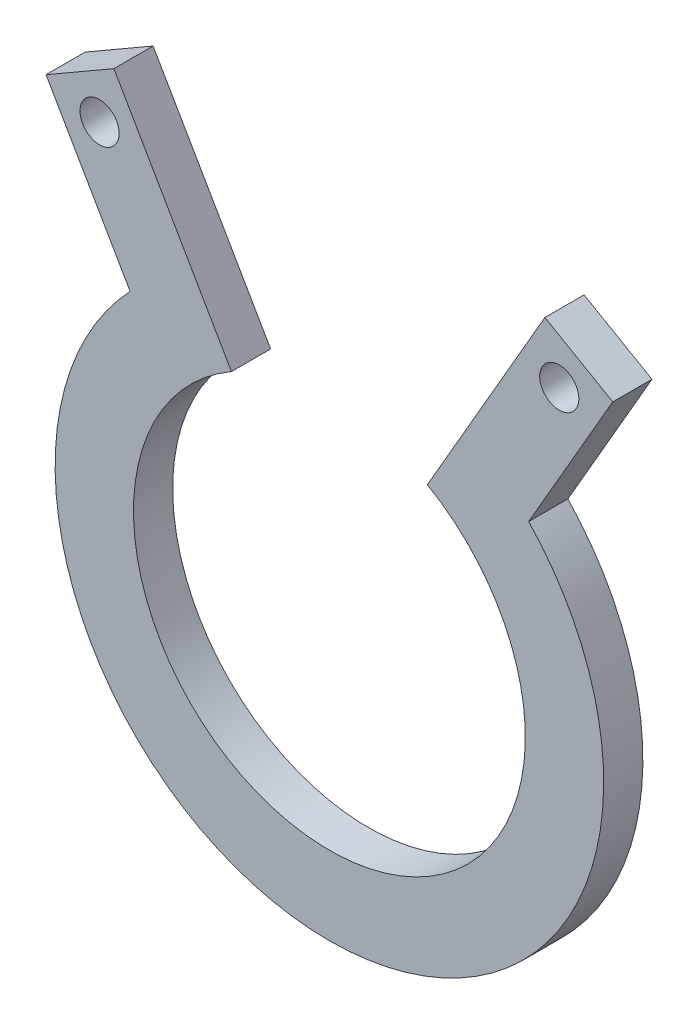
ISO-10303-21;
HEADER;
FILE_DESCRIPTION(('STEP AP214'),'2;1');
FILE_NAME('part.step','',(''),(''),'','','');
FILE_SCHEMA(('AUTOMOTIVE_DESIGN { 1 0 10303 214 1 1 1 1 }'));
ENDSEC;
DATA;
#1=APPLICATION_CONTEXT('core data for automotive mechanical design processes');
#2=APPLICATION_PROTOCOL_DEFINITION('international standard','automotive_design',2000,#1);
#3=PRODUCT_CONTEXT('',#1,'mechanical');
#4=PRODUCT('Part','Part','',(#3));
#5=PRODUCT_RELATED_PRODUCT_CATEGORY('part','',(#4));
#6=PRODUCT_DEFINITION_FORMATION('','',#4);
#7=PRODUCT_DEFINITION_CONTEXT('part definition',#1,'design');
#8=PRODUCT_DEFINITION('design','',#6,#7);
#9=PRODUCT_DEFINITION_SHAPE('','',#8);
#10=(LENGTH_UNIT() NAMED_UNIT(*) SI_UNIT(.MILLI.,.METRE.));
#11=(NAMED_UNIT(*) PLANE_ANGLE_UNIT() SI_UNIT($,.RADIAN.));
#12=(NAMED_UNIT(*) SI_UNIT($,.STERADIAN.) SOLID_ANGLE_UNIT());
#13=UNCERTAINTY_MEASURE_WITH_UNIT(LENGTH_MEASURE(1.E-05),#10,'distance_accuracy_value','');
#14=(GEOMETRIC_REPRESENTATION_CONTEXT(3) GLOBAL_UNCERTAINTY_ASSIGNED_CONTEXT((#13)) GLOBAL_UNIT_ASSIGNED_CONTEXT((#10,
#11,#12)) REPRESENTATION_CONTEXT('',''));
#15=CARTESIAN_POINT('',(0.,0.,0.));
#16=DIRECTION('',(0.,0.,1.));
#17=DIRECTION('',(1.,0.,0.));
#18=AXIS2_PLACEMENT_3D('',#15,#16,#17);
#19=CARTESIAN_POINT('',(0.,0.,3.175));
#20=DIRECTION('',(0.,0.,-1.));
#21=DIRECTION('',(-1.,0.,0.));
#22=AXIS2_PLACEMENT_3D('',#19,#20,#21);
#23=CYLINDRICAL_SURFACE('',#22,22.225);
#24=DIRECTION('',(0.,0.,1.));
#25=VECTOR('',#24,1.);
#26=CARTESIAN_POINT('',(16.148535056874,15.2700831863127,-19.0966279206907));
#27=LINE('',#26,#25);
#28=CARTESIAN_POINT('',(16.148535056874,15.2700831863127,0.));
#29=VERTEX_POINT('',#28);
#30=CARTESIAN_POINT('',(16.148535056874,15.2700831863127,3.175));
#31=VERTEX_POINT('',#30);
#32=EDGE_CURVE('E64',#29,#31,#27,.T.);
#33=ORIENTED_EDGE('',*,*,#32,.T.);
#34=CARTESIAN_POINT('',(0.,0.,3.175));
#35=DIRECTION('',(0.,0.,1.));
#36=DIRECTION('',(1.,0.,0.));
#37=AXIS2_PLACEMENT_3D('',#34,#35,#36);
#38=CIRCLE('',#37,22.225);
#39=CARTESIAN_POINT('',(-16.148535056874,15.2700831863127,3.175));
#40=VERTEX_POINT('',#39);
#41=EDGE_CURVE('E56',#40,#31,#38,.T.);
#42=ORIENTED_EDGE('',*,*,#41,.F.);
#43=DIRECTION('',(0.,0.,1.));
#44=VECTOR('',#43,1.);
#45=CARTESIAN_POINT('',(-16.148535056874,15.2700831863127,-19.0966279206907));
#46=LINE('',#45,#44);
#47=CARTESIAN_POINT('',(-16.148535056874,15.2700831863127,0.));
#48=VERTEX_POINT('',#47);
#49=EDGE_CURVE('E144',#48,#40,#46,.T.);
#50=ORIENTED_EDGE('',*,*,#49,.F.);
#51=CARTESIAN_POINT('',(0.,0.,0.));
#52=DIRECTION('',(0.,0.,1.));
#53=DIRECTION('',(1.,0.,0.));
#54=AXIS2_PLACEMENT_3D('',#51,#52,#53);
#55=CIRCLE('',#54,22.225);
#56=EDGE_CURVE('E69',#48,#29,#55,.T.);
#57=ORIENTED_EDGE('',*,*,#56,.T.);
#58=EDGE_LOOP('',(#33,#42,#50,#57));
#59=FACE_BOUND('',#58,.T.);
#60=ADVANCED_FACE('F48',(#59),#23,.T.);
#61=CARTESIAN_POINT('',(0.,0.,3.175));
#62=DIRECTION('',(0.,0.,-1.));
#63=DIRECTION('',(-1.,0.,0.));
#64=AXIS2_PLACEMENT_3D('',#61,#62,#63);
#65=CYLINDRICAL_SURFACE('',#64,15.875);
#66=DIRECTION('',(0.,0.,-1.));
#67=VECTOR('',#66,1.);
#68=CARTESIAN_POINT('',(7.93750000000002,13.748153285078,3.175));
#69=LINE('',#68,#67);
#70=CARTESIAN_POINT('',(7.93750000000002,13.748153285078,0.));
#71=VERTEX_POINT('',#70);
#72=CARTESIAN_POINT('',(7.93750000000002,13.748153285078,3.175));
#73=VERTEX_POINT('',#72);
#74=EDGE_CURVE('E131',#71,#73,#69,.F.);
#75=ORIENTED_EDGE('',*,*,#74,.F.);
#76=CARTESIAN_POINT('',(0.,0.,0.));
#77=DIRECTION('',(0.,0.,1.));
#78=DIRECTION('',(1.,0.,0.));
#79=AXIS2_PLACEMENT_3D('',#76,#77,#78);
#80=CIRCLE('',#79,15.875);
#81=CARTESIAN_POINT('',(-7.93750000000004,13.7481532850779,0.));
#82=VERTEX_POINT('',#81);
#83=EDGE_CURVE('E51',#82,#71,#80,.T.);
#84=ORIENTED_EDGE('',*,*,#83,.F.);
#85=DIRECTION('',(0.,0.,-1.));
#86=VECTOR('',#85,1.);
#87=CARTESIAN_POINT('',(-7.93750000000004,13.7481532850779,3.175));
#88=LINE('',#87,#86);
#89=CARTESIAN_POINT('',(-7.93750000000004,13.7481532850779,3.175));
#90=VERTEX_POINT('',#89);
#91=EDGE_CURVE('E125',#90,#82,#88,.T.);
#92=ORIENTED_EDGE('',*,*,#91,.F.);
#93=CARTESIAN_POINT('',(0.,0.,3.175));
#94=DIRECTION('',(0.,0.,1.));
#95=DIRECTION('',(1.,0.,0.));
#96=AXIS2_PLACEMENT_3D('',#93,#94,#95);
#97=CIRCLE('',#96,15.875);
#98=EDGE_CURVE('E13',#90,#73,#97,.T.);
#99=ORIENTED_EDGE('',*,*,#98,.T.);
#100=EDGE_LOOP('',(#75,#84,#92,#99));
#101=FACE_BOUND('',#100,.T.);
#102=ADVANCED_FACE('F134',(#101),#65,.F.);
#103=CARTESIAN_POINT('',(0.,0.,3.175));
#104=DIRECTION('',(0.,0.,1.));
#105=DIRECTION('',(1.,0.,0.));
#106=AXIS2_PLACEMENT_3D('',#103,#104,#105);
#107=PLANE('',#106);
#108=DIRECTION('',(-0.500000000000004,-0.866025403784436,0.));
#109=VECTOR('',#108,1.);
#110=CARTESIAN_POINT('',(0.,0.,3.175));
#111=LINE('',#110,#109);
#112=CARTESIAN_POINT('',(17.4625000000001,30.2459372271715,3.175));
#113=VERTEX_POINT('',#112);
#114=EDGE_CURVE('E177',#113,#73,#111,.T.);
#115=ORIENTED_EDGE('',*,*,#114,.T.);
#116=ORIENTED_EDGE('',*,*,#98,.F.);
#117=DIRECTION('',(-0.500000000000001,0.866025403784438,0.));
#118=VECTOR('',#117,1.);
#119=CARTESIAN_POINT('',(0.,0.,3.175));
#120=LINE('',#119,#118);
#121=CARTESIAN_POINT('',(-17.4625000000001,30.2459372271715,3.175));
#122=VERTEX_POINT('',#121);
#123=EDGE_CURVE('E128',#90,#122,#120,.T.);
#124=ORIENTED_EDGE('',*,*,#123,.T.);
#125=DIRECTION('',(-0.866025403784438,-0.5,0.));
#126=VECTOR('',#125,1.);
#127=CARTESIAN_POINT('',(-17.4625,30.2459372271715,3.175));
#128=LINE('',#127,#126);
#129=CARTESIAN_POINT('',(-22.9617613140313,27.0709372271715,3.175));
#130=VERTEX_POINT('',#129);
#131=EDGE_CURVE('E147',#122,#130,#128,.T.);
#132=ORIENTED_EDGE('',*,*,#131,.T.);
#133=DIRECTION('',(0.499999999999999,-0.86602540378444,0.));
#134=VECTOR('',#133,1.);
#135=CARTESIAN_POINT('',(-5.49926131403132,-3.17500000000006,3.175));
#136=LINE('',#135,#134);
#137=EDGE_CURVE('E157',#130,#40,#136,.T.);
#138=ORIENTED_EDGE('',*,*,#137,.T.);
#139=ORIENTED_EDGE('',*,*,#41,.T.);
#140=DIRECTION('',(-0.499999999999999,-0.86602540378444,0.));
#141=VECTOR('',#140,1.);
#142=CARTESIAN_POINT('',(5.49926131403132,-3.17500000000006,3.175));
#143=LINE('',#142,#141);
#144=CARTESIAN_POINT('',(22.9617613140313,27.0709372271715,3.175));
#145=VERTEX_POINT('',#144);
#146=EDGE_CURVE('E178',#145,#31,#143,.T.);
#147=ORIENTED_EDGE('',*,*,#146,.F.);
#148=DIRECTION('',(0.866025403784438,-0.500000000000001,0.));
#149=VECTOR('',#148,1.);
#150=CARTESIAN_POINT('',(17.4625,30.2459372271715,3.175));
#151=LINE('',#150,#149);
#152=EDGE_CURVE('E170',#113,#145,#151,.T.);
#153=ORIENTED_EDGE('',*,*,#152,.F.);
#154=EDGE_LOOP('',(#115,#116,#124,#132,#138,#139,#147,#153));
#155=FACE_BOUND('',#154,.T.);
#156=CARTESIAN_POINT('',(-18.6246306570157,25.9088065701559,3.175));
#157=DIRECTION('',(0.,0.,1.));
#158=DIRECTION('',(1.,0.,0.));
#159=AXIS2_PLACEMENT_3D('',#156,#157,#158);
#160=CIRCLE('',#159,1.58749999999998);
#161=CARTESIAN_POINT('',(-17.0371306570157,25.9088065701559,3.175));
#162=VERTEX_POINT('',#161);
#163=EDGE_CURVE('E148',#162,#162,#160,.T.);
#164=ORIENTED_EDGE('',*,*,#163,.F.);
#165=EDGE_LOOP('',(#164));
#166=FACE_BOUND('',#165,.T.);
#167=CARTESIAN_POINT('',(18.6246306570157,25.9088065701559,3.175));
#168=DIRECTION('',(0.,0.,1.));
#169=DIRECTION('',(1.,0.,0.));
#170=AXIS2_PLACEMENT_3D('',#167,#168,#169);
#171=CIRCLE('',#170,1.58749999999998);
#172=CARTESIAN_POINT('',(20.2121306570157,25.9088065701559,3.175));
#173=VERTEX_POINT('',#172);
#174=EDGE_CURVE('E164',#173,#173,#171,.F.);
#175=ORIENTED_EDGE('',*,*,#174,.T.);
#176=EDGE_LOOP('',(#175));
#177=FACE_BOUND('',#176,.T.);
#178=ADVANCED_FACE('F192',(#155,#166,#177),#107,.T.);
#179=CARTESIAN_POINT('',(0.,0.,0.));
#180=DIRECTION('',(0.,0.,1.));
#181=DIRECTION('',(1.,0.,0.));
#182=AXIS2_PLACEMENT_3D('',#179,#180,#181);
#183=PLANE('',#182);
#184=ORIENTED_EDGE('',*,*,#83,.T.);
#185=DIRECTION('',(0.500000000000004,0.866025403784436,0.));
#186=VECTOR('',#185,1.);
#187=CARTESIAN_POINT('',(0.,0.,0.));
#188=LINE('',#187,#186);
#189=CARTESIAN_POINT('',(17.4625000000001,30.2459372271715,0.));
#190=VERTEX_POINT('',#189);
#191=EDGE_CURVE('E143',#71,#190,#188,.T.);
#192=ORIENTED_EDGE('',*,*,#191,.T.);
#193=DIRECTION('',(-0.866025403784438,0.500000000000001,0.));
#194=VECTOR('',#193,1.);
#195=CARTESIAN_POINT('',(17.4625,30.2459372271715,0.));
#196=LINE('',#195,#194);
#197=CARTESIAN_POINT('',(22.9617613140313,27.0709372271715,0.));
#198=VERTEX_POINT('',#197);
#199=EDGE_CURVE('E171',#198,#190,#196,.T.);
#200=ORIENTED_EDGE('',*,*,#199,.F.);
#201=DIRECTION('',(0.499999999999999,0.866025403784439,0.));
#202=VECTOR('',#201,1.);
#203=CARTESIAN_POINT('',(5.49926131403132,-3.17500000000006,0.));
#204=LINE('',#203,#202);
#205=EDGE_CURVE('E166',#29,#198,#204,.T.);
#206=ORIENTED_EDGE('',*,*,#205,.F.);
#207=ORIENTED_EDGE('',*,*,#56,.F.);
#208=DIRECTION('',(-0.499999999999999,0.866025403784439,0.));
#209=VECTOR('',#208,1.);
#210=CARTESIAN_POINT('',(-5.49926131403132,-3.17500000000006,0.));
#211=LINE('',#210,#209);
#212=CARTESIAN_POINT('',(-22.9617613140313,27.0709372271715,0.));
#213=VERTEX_POINT('',#212);
#214=EDGE_CURVE('E122',#48,#213,#211,.T.);
#215=ORIENTED_EDGE('',*,*,#214,.T.);
#216=DIRECTION('',(0.866025403784439,0.5,0.));
#217=VECTOR('',#216,1.);
#218=CARTESIAN_POINT('',(-17.4625,30.2459372271715,0.));
#219=LINE('',#218,#217);
#220=CARTESIAN_POINT('',(-17.4625000000001,30.2459372271715,0.));
#221=VERTEX_POINT('',#220);
#222=EDGE_CURVE('E119',#213,#221,#219,.T.);
#223=ORIENTED_EDGE('',*,*,#222,.T.);
#224=DIRECTION('',(0.500000000000001,-0.866025403784438,0.));
#225=VECTOR('',#224,1.);
#226=CARTESIAN_POINT('',(0.,0.,0.));
#227=LINE('',#226,#225);
#228=EDGE_CURVE('E113',#221,#82,#227,.T.);
#229=ORIENTED_EDGE('',*,*,#228,.T.);
#230=EDGE_LOOP('',(#184,#192,#200,#206,#207,#215,#223,#229));
#231=FACE_BOUND('',#230,.T.);
#232=CARTESIAN_POINT('',(-18.6246306570157,25.9088065701559,0.));
#233=DIRECTION('',(0.,0.,1.));
#234=DIRECTION('',(1.,0.,0.));
#235=AXIS2_PLACEMENT_3D('',#232,#233,#234);
#236=CIRCLE('',#235,1.58749999999998);
#237=CARTESIAN_POINT('',(-17.0371306570157,25.9088065701559,0.));
#238=VERTEX_POINT('',#237);
#239=EDGE_CURVE('E149',#238,#238,#236,.F.);
#240=ORIENTED_EDGE('',*,*,#239,.F.);
#241=EDGE_LOOP('',(#240));
#242=FACE_BOUND('',#241,.T.);
#243=CARTESIAN_POINT('',(18.6246306570157,25.9088065701559,0.));
#244=DIRECTION('',(0.,0.,1.));
#245=DIRECTION('',(1.,0.,0.));
#246=AXIS2_PLACEMENT_3D('',#243,#244,#245);
#247=CIRCLE('',#246,1.58749999999998);
#248=CARTESIAN_POINT('',(20.2121306570157,25.9088065701559,0.));
#249=VERTEX_POINT('',#248);
#250=EDGE_CURVE('E161',#249,#249,#247,.T.);
#251=ORIENTED_EDGE('',*,*,#250,.T.);
#252=EDGE_LOOP('',(#251));
#253=FACE_BOUND('',#252,.T.);
#254=ADVANCED_FACE('F115',(#231,#242,#253),#183,.F.);
#255=CARTESIAN_POINT('',(-17.4625,30.2459372271715,-19.0966279206907));
#256=DIRECTION('',(-0.5,0.866025403784439,0.));
#257=DIRECTION('',(-0.866025403784439,-0.5,0.));
#258=AXIS2_PLACEMENT_3D('',#255,#256,#257);
#259=PLANE('',#258);
#260=ORIENTED_EDGE('',*,*,#222,.F.);
#261=DIRECTION('',(0.,0.,1.));
#262=VECTOR('',#261,1.);
#263=CARTESIAN_POINT('',(-22.9617613140313,27.0709372271715,-19.0966279206907));
#264=LINE('',#263,#262);
#265=EDGE_CURVE('E140',#213,#130,#264,.T.);
#266=ORIENTED_EDGE('',*,*,#265,.T.);
#267=ORIENTED_EDGE('',*,*,#131,.F.);
#268=DIRECTION('',(0.,0.,1.));
#269=VECTOR('',#268,1.);
#270=CARTESIAN_POINT('',(-17.4625000000001,30.2459372271715,-19.0966279206907));
#271=LINE('',#270,#269);
#272=EDGE_CURVE('E142',#221,#122,#271,.T.);
#273=ORIENTED_EDGE('',*,*,#272,.F.);
#274=EDGE_LOOP('',(#260,#266,#267,#273));
#275=FACE_BOUND('',#274,.T.);
#276=ADVANCED_FACE('F221',(#275),#259,.T.);
#277=CARTESIAN_POINT('',(0.,0.,-19.0966279206907));
#278=DIRECTION('',(0.866025403784438,0.500000000000001,0.));
#279=DIRECTION('',(-0.500000000000001,0.866025403784438,0.));
#280=AXIS2_PLACEMENT_3D('',#277,#278,#279);
#281=PLANE('',#280);
#282=ORIENTED_EDGE('',*,*,#228,.F.);
#283=ORIENTED_EDGE('',*,*,#272,.T.);
#284=ORIENTED_EDGE('',*,*,#123,.F.);
#285=ORIENTED_EDGE('',*,*,#91,.T.);
#286=EDGE_LOOP('',(#282,#283,#284,#285));
#287=FACE_BOUND('',#286,.T.);
#288=ADVANCED_FACE('F126',(#287),#281,.T.);
#289=CARTESIAN_POINT('',(-18.6246306570157,25.9088065701559,-19.0966279206907));
#290=DIRECTION('',(0.,0.,1.));
#291=DIRECTION('',(1.,0.,0.));
#292=AXIS2_PLACEMENT_3D('',#289,#290,#291);
#293=CYLINDRICAL_SURFACE('',#292,1.58749999999998);
#294=ORIENTED_EDGE('',*,*,#239,.T.);
#295=EDGE_LOOP('',(#294));
#296=FACE_BOUND('',#295,.T.);
#297=ORIENTED_EDGE('',*,*,#163,.T.);
#298=EDGE_LOOP('',(#297));
#299=FACE_BOUND('',#298,.T.);
#300=ADVANCED_FACE('F228',(#296,#299),#293,.F.);
#301=CARTESIAN_POINT('',(-5.49926131403132,-3.17500000000006,-19.0966279206907));
#302=DIRECTION('',(-0.866025403784439,-0.499999999999999,0.));
#303=DIRECTION('',(0.499999999999999,-0.866025403784439,0.));
#304=AXIS2_PLACEMENT_3D('',#301,#302,#303);
#305=PLANE('',#304);
#306=ORIENTED_EDGE('',*,*,#214,.F.);
#307=ORIENTED_EDGE('',*,*,#49,.T.);
#308=ORIENTED_EDGE('',*,*,#137,.F.);
#309=ORIENTED_EDGE('',*,*,#265,.F.);
#310=EDGE_LOOP('',(#306,#307,#308,#309));
#311=FACE_BOUND('',#310,.T.);
#312=ADVANCED_FACE('F209',(#311),#305,.T.);
#313=CARTESIAN_POINT('',(17.4625,30.2459372271715,-19.0966279206907));
#314=DIRECTION('',(-0.500000000000001,-0.866025403784438,0.));
#315=DIRECTION('',(0.866025403784438,-0.500000000000001,0.));
#316=AXIS2_PLACEMENT_3D('',#313,#314,#315);
#317=PLANE('',#316);
#318=DIRECTION('',(0.,0.,1.));
#319=VECTOR('',#318,1.);
#320=CARTESIAN_POINT('',(22.9617613140313,27.0709372271715,-19.0966279206907));
#321=LINE('',#320,#319);
#322=EDGE_CURVE('E169',#198,#145,#321,.T.);
#323=ORIENTED_EDGE('',*,*,#322,.F.);
#324=ORIENTED_EDGE('',*,*,#199,.T.);
#325=DIRECTION('',(0.,0.,1.));
#326=VECTOR('',#325,1.);
#327=CARTESIAN_POINT('',(17.4625000000001,30.2459372271715,-19.0966279206907));
#328=LINE('',#327,#326);
#329=EDGE_CURVE('E174',#190,#113,#328,.T.);
#330=ORIENTED_EDGE('',*,*,#329,.T.);
#331=ORIENTED_EDGE('',*,*,#152,.T.);
#332=EDGE_LOOP('',(#323,#324,#330,#331));
#333=FACE_BOUND('',#332,.T.);
#334=ADVANCED_FACE('F198',(#333),#317,.F.);
#335=CARTESIAN_POINT('',(5.49926131403132,-3.17500000000006,-19.0966279206907));
#336=DIRECTION('',(-0.866025403784439,0.499999999999999,0.));
#337=DIRECTION('',(-0.499999999999999,-0.866025403784439,0.));
#338=AXIS2_PLACEMENT_3D('',#335,#336,#337);
#339=PLANE('',#338);
#340=ORIENTED_EDGE('',*,*,#32,.F.);
#341=ORIENTED_EDGE('',*,*,#205,.T.);
#342=ORIENTED_EDGE('',*,*,#322,.T.);
#343=ORIENTED_EDGE('',*,*,#146,.T.);
#344=EDGE_LOOP('',(#340,#341,#342,#343));
#345=FACE_BOUND('',#344,.T.);
#346=ADVANCED_FACE('F200',(#345),#339,.F.);
#347=CARTESIAN_POINT('',(0.,0.,-19.0966279206907));
#348=DIRECTION('',(-0.866025403784436,0.500000000000004,0.));
#349=DIRECTION('',(-0.500000000000004,-0.866025403784436,0.));
#350=AXIS2_PLACEMENT_3D('',#347,#348,#349);
#351=PLANE('',#350);
#352=ORIENTED_EDGE('',*,*,#191,.F.);
#353=ORIENTED_EDGE('',*,*,#74,.T.);
#354=ORIENTED_EDGE('',*,*,#114,.F.);
#355=ORIENTED_EDGE('',*,*,#329,.F.);
#356=EDGE_LOOP('',(#352,#353,#354,#355));
#357=FACE_BOUND('',#356,.T.);
#358=ADVANCED_FACE('F189',(#357),#351,.T.);
#359=CARTESIAN_POINT('',(18.6246306570157,25.9088065701559,-19.0966279206907));
#360=DIRECTION('',(0.,0.,1.));
#361=DIRECTION('',(1.,0.,0.));
#362=AXIS2_PLACEMENT_3D('',#359,#360,#361);
#363=CYLINDRICAL_SURFACE('',#362,1.58749999999998);
#364=ORIENTED_EDGE('',*,*,#250,.F.);
#365=EDGE_LOOP('',(#364));
#366=FACE_BOUND('',#365,.T.);
#367=ORIENTED_EDGE('',*,*,#174,.F.);
#368=EDGE_LOOP('',(#367));
#369=FACE_BOUND('',#368,.T.);
#370=ADVANCED_FACE('F207',(#366,#369),#363,.F.);
#371=CLOSED_SHELL('',(#60,#102,#178,#254,#276,#288,#300,#312,#334,#346,#358,#370));
#372=MANIFOLD_SOLID_BREP('B2',#371);
#373=ADVANCED_BREP_SHAPE_REPRESENTATION('',(#18,#372),#14);
#374=SHAPE_DEFINITION_REPRESENTATION(#9,#373);
ENDSEC;
END-ISO-10303-21;
